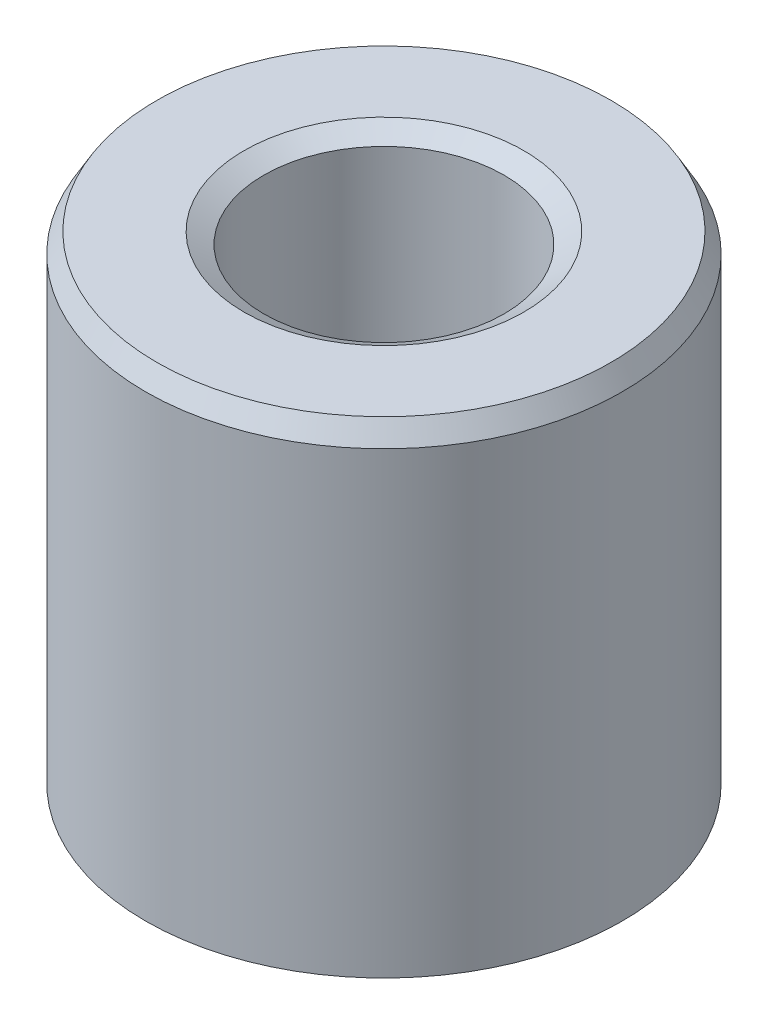
ISO-10303-21;
HEADER;
FILE_DESCRIPTION(('STEP AP214'),'2;1');
FILE_NAME('part.step','',(''),(''),'','','');
FILE_SCHEMA(('AUTOMOTIVE_DESIGN { 1 0 10303 214 1 1 1 1 }'));
ENDSEC;
DATA;
#1=APPLICATION_CONTEXT('core data for automotive mechanical design processes');
#2=APPLICATION_PROTOCOL_DEFINITION('international standard','automotive_design',2000,#1);
#3=PRODUCT_CONTEXT('',#1,'mechanical');
#4=PRODUCT('Part','Part','',(#3));
#5=PRODUCT_RELATED_PRODUCT_CATEGORY('part','',(#4));
#6=PRODUCT_DEFINITION_FORMATION('','',#4);
#7=PRODUCT_DEFINITION_CONTEXT('part definition',#1,'design');
#8=PRODUCT_DEFINITION('design','',#6,#7);
#9=PRODUCT_DEFINITION_SHAPE('','',#8);
#10=(LENGTH_UNIT() NAMED_UNIT(*) SI_UNIT(.MILLI.,.METRE.));
#11=(NAMED_UNIT(*) PLANE_ANGLE_UNIT() SI_UNIT($,.RADIAN.));
#12=(NAMED_UNIT(*) SI_UNIT($,.STERADIAN.) SOLID_ANGLE_UNIT());
#13=UNCERTAINTY_MEASURE_WITH_UNIT(LENGTH_MEASURE(1.E-05),#10,'distance_accuracy_value','');
#14=(GEOMETRIC_REPRESENTATION_CONTEXT(3) GLOBAL_UNCERTAINTY_ASSIGNED_CONTEXT((#13)) GLOBAL_UNIT_ASSIGNED_CONTEXT((#10,
#11,#12)) REPRESENTATION_CONTEXT('',''));
#15=CARTESIAN_POINT('',(0.,0.,0.));
#16=DIRECTION('',(0.,0.,1.));
#17=DIRECTION('',(1.,0.,0.));
#18=AXIS2_PLACEMENT_3D('',#15,#16,#17);
#19=CARTESIAN_POINT('',(0.,46.1853853348506,0.));
#20=DIRECTION('',(0.,-1.,0.));
#21=DIRECTION('',(0.,0.,-1.));
#22=AXIS2_PLACEMENT_3D('',#19,#20,#21);
#23=CYLINDRICAL_SURFACE('',#22,22.5);
#24=CARTESIAN_POINT('',(0.,1.07431942208348,0.));
#25=DIRECTION('',(0.,1.,0.));
#26=DIRECTION('',(0.,0.,1.));
#27=AXIS2_PLACEMENT_3D('',#24,#25,#26);
#28=CIRCLE('',#27,22.5);
#29=CARTESIAN_POINT('',(0.,1.07431942208348,22.5));
#30=VERTEX_POINT('',#29);
#31=EDGE_CURVE('E10',#30,#30,#28,.T.);
#32=ORIENTED_EDGE('',*,*,#31,.T.);
#33=EDGE_LOOP('',(#32));
#34=FACE_BOUND('',#33,.T.);
#35=CARTESIAN_POINT('',(0.,44.324609512244,0.));
#36=DIRECTION('',(0.,1.,0.));
#37=DIRECTION('',(0.,0.,1.));
#38=AXIS2_PLACEMENT_3D('',#35,#36,#37);
#39=CIRCLE('',#38,22.5);
#40=CARTESIAN_POINT('',(0.,44.324609512244,22.5));
#41=VERTEX_POINT('',#40);
#42=EDGE_CURVE('E50',#41,#41,#39,.F.);
#43=ORIENTED_EDGE('',*,*,#42,.T.);
#44=EDGE_LOOP('',(#43));
#45=FACE_BOUND('',#44,.T.);
#46=ADVANCED_FACE('F39',(#34,#45),#23,.T.);
#47=CARTESIAN_POINT('',(0.,46.1853853348506,0.));
#48=DIRECTION('',(0.,1.,0.));
#49=DIRECTION('',(0.,0.,1.));
#50=AXIS2_PLACEMENT_3D('',#47,#48,#49);
#51=PLANE('',#50);
#52=CARTESIAN_POINT('',(0.,46.1853853348506,0.));
#53=DIRECTION('',(0.,1.,0.));
#54=DIRECTION('',(0.,0.,1.));
#55=AXIS2_PLACEMENT_3D('',#52,#53,#54);
#56=CIRCLE('',#55,13.2020189240191);
#57=CARTESIAN_POINT('',(0.,46.1853853348506,13.2020189240191));
#58=VERTEX_POINT('',#57);
#59=EDGE_CURVE('E58',#58,#58,#56,.F.);
#60=ORIENTED_EDGE('',*,*,#59,.T.);
#61=EDGE_LOOP('',(#60));
#62=FACE_BOUND('',#61,.T.);
#63=CARTESIAN_POINT('',(0.,46.1853853348506,0.));
#64=DIRECTION('',(0.,1.,0.));
#65=DIRECTION('',(0.,0.,1.));
#66=AXIS2_PLACEMENT_3D('',#63,#64,#65);
#67=CIRCLE('',#66,21.4256805779165);
#68=CARTESIAN_POINT('',(0.,46.1853853348506,21.4256805779165));
#69=VERTEX_POINT('',#68);
#70=EDGE_CURVE('E61',#69,#69,#67,.T.);
#71=ORIENTED_EDGE('',*,*,#70,.T.);
#72=EDGE_LOOP('',(#71));
#73=FACE_BOUND('',#72,.T.);
#74=ADVANCED_FACE('F88',(#62,#73),#51,.T.);
#75=CARTESIAN_POINT('',(0.,0.,0.));
#76=DIRECTION('',(0.,1.,0.));
#77=DIRECTION('',(0.,0.,1.));
#78=AXIS2_PLACEMENT_3D('',#75,#76,#77);
#79=PLANE('',#78);
#80=CARTESIAN_POINT('',(0.,0.,0.));
#81=DIRECTION('',(0.,1.,0.));
#82=DIRECTION('',(0.,0.,1.));
#83=AXIS2_PLACEMENT_3D('',#80,#81,#82);
#84=CIRCLE('',#83,12.4155625234959);
#85=CARTESIAN_POINT('',(0.,0.,12.4155625234959));
#86=VERTEX_POINT('',#85);
#87=EDGE_CURVE('E51',#86,#86,#84,.T.);
#88=ORIENTED_EDGE('',*,*,#87,.T.);
#89=EDGE_LOOP('',(#88));
#90=FACE_BOUND('',#89,.T.);
#91=CARTESIAN_POINT('',(0.,0.,0.));
#92=DIRECTION('',(0.,1.,0.));
#93=DIRECTION('',(0.,0.,1.));
#94=AXIS2_PLACEMENT_3D('',#91,#92,#93);
#95=CIRCLE('',#94,20.6392241773934);
#96=CARTESIAN_POINT('',(0.,0.,20.6392241773934));
#97=VERTEX_POINT('',#96);
#98=EDGE_CURVE('E54',#97,#97,#95,.F.);
#99=ORIENTED_EDGE('',*,*,#98,.T.);
#100=EDGE_LOOP('',(#99));
#101=FACE_BOUND('',#100,.T.);
#102=ADVANCED_FACE('F83',(#90,#101),#79,.F.);
#103=CARTESIAN_POINT('',(0.,46.1853853348506,0.));
#104=DIRECTION('',(0.,-1.,0.));
#105=DIRECTION('',(0.,0.,-1.));
#106=AXIS2_PLACEMENT_3D('',#103,#104,#105);
#107=CYLINDRICAL_SURFACE('',#106,11.3412431014124);
#108=CARTESIAN_POINT('',(0.,45.1110659127672,0.));
#109=DIRECTION('',(0.,1.,0.));
#110=DIRECTION('',(0.,0.,1.));
#111=AXIS2_PLACEMENT_3D('',#108,#109,#110);
#112=CIRCLE('',#111,11.3412431014124);
#113=CARTESIAN_POINT('',(0.,45.1110659127672,11.3412431014124));
#114=VERTEX_POINT('',#113);
#115=EDGE_CURVE('E67',#114,#114,#112,.T.);
#116=ORIENTED_EDGE('',*,*,#115,.T.);
#117=EDGE_LOOP('',(#116));
#118=FACE_BOUND('',#117,.T.);
#119=CARTESIAN_POINT('',(0.,1.86077582260663,0.));
#120=DIRECTION('',(0.,1.,0.));
#121=DIRECTION('',(0.,0.,1.));
#122=AXIS2_PLACEMENT_3D('',#119,#120,#121);
#123=CIRCLE('',#122,11.3412431014124);
#124=CARTESIAN_POINT('',(0.,1.86077582260663,11.3412431014124));
#125=VERTEX_POINT('',#124);
#126=EDGE_CURVE('E69',#125,#125,#123,.F.);
#127=ORIENTED_EDGE('',*,*,#126,.T.);
#128=EDGE_LOOP('',(#127));
#129=FACE_BOUND('',#128,.T.);
#130=ADVANCED_FACE('F71',(#118,#129),#107,.F.);
#131=CARTESIAN_POINT('',(0.,45.1110659127672,0.));
#132=DIRECTION('',(0.,1.,0.));
#133=DIRECTION('',(0.,0.,1.));
#134=AXIS2_PLACEMENT_3D('',#131,#132,#133);
#135=CONICAL_SURFACE('',#134,11.3412431014124,1.0471975511966);
#136=ORIENTED_EDGE('',*,*,#59,.F.);
#137=EDGE_LOOP('',(#136));
#138=FACE_BOUND('',#137,.T.);
#139=ORIENTED_EDGE('',*,*,#115,.F.);
#140=EDGE_LOOP('',(#139));
#141=FACE_BOUND('',#140,.T.);
#142=ADVANCED_FACE('F77',(#138,#141),#135,.F.);
#143=CARTESIAN_POINT('',(0.,0.,0.));
#144=DIRECTION('',(0.,-1.,0.));
#145=DIRECTION('',(0.,0.,-1.));
#146=AXIS2_PLACEMENT_3D('',#143,#144,#145);
#147=CONICAL_SURFACE('',#146,12.4155625234959,0.523598775598297);
#148=ORIENTED_EDGE('',*,*,#126,.F.);
#149=EDGE_LOOP('',(#148));
#150=FACE_BOUND('',#149,.T.);
#151=ORIENTED_EDGE('',*,*,#87,.F.);
#152=EDGE_LOOP('',(#151));
#153=FACE_BOUND('',#152,.T.);
#154=ADVANCED_FACE('F73',(#150,#153),#147,.F.);
#155=CARTESIAN_POINT('',(0.,1.07431942208348,0.));
#156=DIRECTION('',(0.,1.,0.));
#157=DIRECTION('',(0.,0.,1.));
#158=AXIS2_PLACEMENT_3D('',#155,#156,#157);
#159=CONICAL_SURFACE('',#158,22.5,1.0471975511966);
#160=ORIENTED_EDGE('',*,*,#98,.F.);
#161=EDGE_LOOP('',(#160));
#162=FACE_BOUND('',#161,.T.);
#163=ORIENTED_EDGE('',*,*,#31,.F.);
#164=EDGE_LOOP('',(#163));
#165=FACE_BOUND('',#164,.T.);
#166=ADVANCED_FACE('F76',(#162,#165),#159,.T.);
#167=CARTESIAN_POINT('',(0.,46.1853853348506,0.));
#168=DIRECTION('',(0.,-1.,0.));
#169=DIRECTION('',(0.,0.,-1.));
#170=AXIS2_PLACEMENT_3D('',#167,#168,#169);
#171=CONICAL_SURFACE('',#170,21.4256805779165,0.523598775598297);
#172=ORIENTED_EDGE('',*,*,#42,.F.);
#173=EDGE_LOOP('',(#172));
#174=FACE_BOUND('',#173,.T.);
#175=ORIENTED_EDGE('',*,*,#70,.F.);
#176=EDGE_LOOP('',(#175));
#177=FACE_BOUND('',#176,.T.);
#178=ADVANCED_FACE('F45',(#174,#177),#171,.T.);
#179=CLOSED_SHELL('',(#46,#74,#102,#130,#142,#154,#166,#178));
#180=MANIFOLD_SOLID_BREP('B2',#179);
#181=ADVANCED_BREP_SHAPE_REPRESENTATION('',(#18,#180),#14);
#182=SHAPE_DEFINITION_REPRESENTATION(#9,#181);
ENDSEC;
END-ISO-10303-21;
